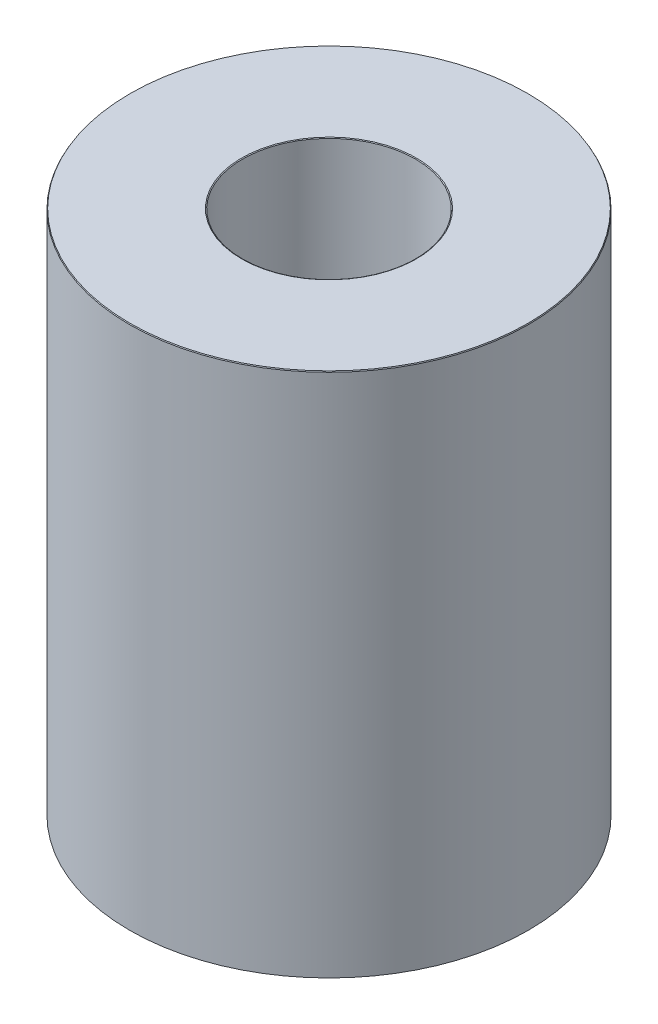
ISO-10303-21;
HEADER;
FILE_DESCRIPTION(('STEP AP214'),'2;1');
FILE_NAME('part.step','',(''),(''),'','','');
FILE_SCHEMA(('AUTOMOTIVE_DESIGN { 1 0 10303 214 1 1 1 1 }'));
ENDSEC;
DATA;
#1=APPLICATION_CONTEXT('core data for automotive mechanical design processes');
#2=APPLICATION_PROTOCOL_DEFINITION('international standard','automotive_design',2000,#1);
#3=PRODUCT_CONTEXT('',#1,'mechanical');
#4=PRODUCT('Part','Part','',(#3));
#5=PRODUCT_RELATED_PRODUCT_CATEGORY('part','',(#4));
#6=PRODUCT_DEFINITION_FORMATION('','',#4);
#7=PRODUCT_DEFINITION_CONTEXT('part definition',#1,'design');
#8=PRODUCT_DEFINITION('design','',#6,#7);
#9=PRODUCT_DEFINITION_SHAPE('','',#8);
#10=(LENGTH_UNIT() NAMED_UNIT(*) SI_UNIT(.MILLI.,.METRE.));
#11=(NAMED_UNIT(*) PLANE_ANGLE_UNIT() SI_UNIT($,.RADIAN.));
#12=(NAMED_UNIT(*) SI_UNIT($,.STERADIAN.) SOLID_ANGLE_UNIT());
#13=UNCERTAINTY_MEASURE_WITH_UNIT(LENGTH_MEASURE(1.E-05),#10,'distance_accuracy_value','');
#14=(GEOMETRIC_REPRESENTATION_CONTEXT(3) GLOBAL_UNCERTAINTY_ASSIGNED_CONTEXT((#13)) GLOBAL_UNIT_ASSIGNED_CONTEXT((#10,
#11,#12)) REPRESENTATION_CONTEXT('',''));
#15=CARTESIAN_POINT('',(0.,0.,0.));
#16=DIRECTION('',(0.,0.,1.));
#17=DIRECTION('',(1.,0.,0.));
#18=AXIS2_PLACEMENT_3D('',#15,#16,#17);
#19=CARTESIAN_POINT('',(0.,138.423819607549,0.));
#20=DIRECTION('',(0.,-1.,0.));
#21=DIRECTION('',(0.,0.,-1.));
#22=AXIS2_PLACEMENT_3D('',#19,#20,#21);
#23=CYLINDRICAL_SURFACE('',#22,52.5);
#24=CARTESIAN_POINT('',(0.,0.133273477539803,0.));
#25=DIRECTION('',(0.,1.,0.));
#26=DIRECTION('',(0.,0.,1.));
#27=AXIS2_PLACEMENT_3D('',#24,#25,#26);
#28=CIRCLE('',#27,52.5);
#29=CARTESIAN_POINT('',(0.,0.133273477539803,52.5));
#30=VERTEX_POINT('',#29);
#31=EDGE_CURVE('E10',#30,#30,#28,.T.);
#32=ORIENTED_EDGE('',*,*,#31,.T.);
#33=EDGE_LOOP('',(#32));
#34=FACE_BOUND('',#33,.T.);
#35=CARTESIAN_POINT('',(0.,138.192983173148,0.));
#36=DIRECTION('',(0.,1.,0.));
#37=DIRECTION('',(0.,0.,1.));
#38=AXIS2_PLACEMENT_3D('',#35,#36,#37);
#39=CIRCLE('',#38,52.5);
#40=CARTESIAN_POINT('',(0.,138.192983173148,52.5));
#41=VERTEX_POINT('',#40);
#42=EDGE_CURVE('E50',#41,#41,#39,.F.);
#43=ORIENTED_EDGE('',*,*,#42,.T.);
#44=EDGE_LOOP('',(#43));
#45=FACE_BOUND('',#44,.T.);
#46=ADVANCED_FACE('F39',(#34,#45),#23,.T.);
#47=CARTESIAN_POINT('',(0.,138.423819607549,0.));
#48=DIRECTION('',(0.,1.,0.));
#49=DIRECTION('',(0.,0.,1.));
#50=AXIS2_PLACEMENT_3D('',#47,#48,#49);
#51=PLANE('',#50);
#52=CARTESIAN_POINT('',(0.,138.423819607549,0.));
#53=DIRECTION('',(0.,1.,0.));
#54=DIRECTION('',(0.,0.,1.));
#55=AXIS2_PLACEMENT_3D('',#52,#53,#54);
#56=CIRCLE('',#55,23.0029149297858);
#57=CARTESIAN_POINT('',(0.,138.423819607549,23.0029149297858));
#58=VERTEX_POINT('',#57);
#59=EDGE_CURVE('E58',#58,#58,#56,.F.);
#60=ORIENTED_EDGE('',*,*,#59,.T.);
#61=EDGE_LOOP('',(#60));
#62=FACE_BOUND('',#61,.T.);
#63=CARTESIAN_POINT('',(0.,138.423819607549,0.));
#64=DIRECTION('',(0.,1.,0.));
#65=DIRECTION('',(0.,0.,1.));
#66=AXIS2_PLACEMENT_3D('',#63,#64,#65);
#67=CIRCLE('',#66,52.3667265224602);
#68=CARTESIAN_POINT('',(0.,138.423819607549,52.3667265224602));
#69=VERTEX_POINT('',#68);
#70=EDGE_CURVE('E61',#69,#69,#67,.T.);
#71=ORIENTED_EDGE('',*,*,#70,.T.);
#72=EDGE_LOOP('',(#71));
#73=FACE_BOUND('',#72,.T.);
#74=ADVANCED_FACE('F88',(#62,#73),#51,.T.);
#75=CARTESIAN_POINT('',(0.,0.,0.));
#76=DIRECTION('',(0.,1.,0.));
#77=DIRECTION('',(0.,0.,1.));
#78=AXIS2_PLACEMENT_3D('',#75,#76,#77);
#79=PLANE('',#78);
#80=CARTESIAN_POINT('',(0.,0.,0.));
#81=DIRECTION('',(0.,1.,0.));
#82=DIRECTION('',(0.,0.,1.));
#83=AXIS2_PLACEMENT_3D('',#80,#81,#82);
#84=CIRCLE('',#83,22.9053519729253);
#85=CARTESIAN_POINT('',(0.,0.,-22.9053519729253));
#86=VERTEX_POINT('',#85);
#87=EDGE_CURVE('E51',#86,#86,#84,.T.);
#88=ORIENTED_EDGE('',*,*,#87,.T.);
#89=EDGE_LOOP('',(#88));
#90=FACE_BOUND('',#89,.T.);
#91=CARTESIAN_POINT('',(0.,0.,0.));
#92=DIRECTION('',(0.,1.,0.));
#93=DIRECTION('',(0.,0.,1.));
#94=AXIS2_PLACEMENT_3D('',#91,#92,#93);
#95=CIRCLE('',#94,52.2691635655997);
#96=CARTESIAN_POINT('',(0.,0.,52.2691635655997));
#97=VERTEX_POINT('',#96);
#98=EDGE_CURVE('E54',#97,#97,#95,.F.);
#99=ORIENTED_EDGE('',*,*,#98,.T.);
#100=EDGE_LOOP('',(#99));
#101=FACE_BOUND('',#100,.T.);
#102=ADVANCED_FACE('F83',(#90,#101),#79,.F.);
#103=CARTESIAN_POINT('',(0.,138.423819607549,0.));
#104=DIRECTION('',(0.,-1.,0.));
#105=DIRECTION('',(0.,0.,-1.));
#106=AXIS2_PLACEMENT_3D('',#103,#104,#105);
#107=CYLINDRICAL_SURFACE('',#106,22.7720784953855);
#108=CARTESIAN_POINT('',(0.,138.290546130009,0.));
#109=DIRECTION('',(0.,1.,0.));
#110=DIRECTION('',(0.,0.,1.));
#111=AXIS2_PLACEMENT_3D('',#108,#109,#110);
#112=CIRCLE('',#111,22.7720784953855);
#113=CARTESIAN_POINT('',(0.,138.290546130009,22.7720784953855));
#114=VERTEX_POINT('',#113);
#115=EDGE_CURVE('E67',#114,#114,#112,.T.);
#116=ORIENTED_EDGE('',*,*,#115,.T.);
#117=EDGE_LOOP('',(#116));
#118=FACE_BOUND('',#117,.T.);
#119=CARTESIAN_POINT('',(0.,0.230836434400333,0.));
#120=DIRECTION('',(0.,1.,0.));
#121=DIRECTION('',(0.,0.,1.));
#122=AXIS2_PLACEMENT_3D('',#119,#120,#121);
#123=CIRCLE('',#122,22.7720784953855);
#124=CARTESIAN_POINT('',(0.,0.230836434400333,-22.7720784953855));
#125=VERTEX_POINT('',#124);
#126=EDGE_CURVE('E69',#125,#125,#123,.F.);
#127=ORIENTED_EDGE('',*,*,#126,.T.);
#128=EDGE_LOOP('',(#127));
#129=FACE_BOUND('',#128,.T.);
#130=ADVANCED_FACE('F71',(#118,#129),#107,.F.);
#131=CARTESIAN_POINT('',(0.,138.290546130009,0.));
#132=DIRECTION('',(0.,1.,0.));
#133=DIRECTION('',(0.,0.,1.));
#134=AXIS2_PLACEMENT_3D('',#131,#132,#133);
#135=CONICAL_SURFACE('',#134,22.7720784953855,1.04719755119655);
#136=ORIENTED_EDGE('',*,*,#59,.F.);
#137=EDGE_LOOP('',(#136));
#138=FACE_BOUND('',#137,.T.);
#139=ORIENTED_EDGE('',*,*,#115,.F.);
#140=EDGE_LOOP('',(#139));
#141=FACE_BOUND('',#140,.T.);
#142=ADVANCED_FACE('F77',(#138,#141),#135,.F.);
#143=CARTESIAN_POINT('',(0.,0.,0.));
#144=DIRECTION('',(0.,-1.,0.));
#145=DIRECTION('',(0.,0.,-1.));
#146=AXIS2_PLACEMENT_3D('',#143,#144,#145);
#147=CONICAL_SURFACE('',#146,22.9053519729253,0.523598775598322);
#148=CARTESIAN_POINT('',(0.,0.230836434400333,-22.7720784953855));
#149=CARTESIAN_POINT('',(0.,0.228431888208662,-22.7734667607765));
#150=CARTESIAN_POINT('',(0.,0.226027342016993,-22.7748550261675));
#151=CARTESIAN_POINT('',(0.,0.221218249633653,-22.7776315569496));
#152=CARTESIAN_POINT('',(0.,0.218813703441983,-22.7790198223407));
#153=CARTESIAN_POINT('',(0.,0.214004611058643,-22.7817963531227));
#154=CARTESIAN_POINT('',(0.,0.211600064866972,-22.7831846185138));
#155=CARTESIAN_POINT('',(0.,0.206790972483632,-22.7859611492959));
#156=CARTESIAN_POINT('',(0.,0.204386426291961,-22.7873494146869));
#157=CARTESIAN_POINT('',(0.,0.199577333908621,-22.790125945469));
#158=CARTESIAN_POINT('',(0.,0.197172787716951,-22.79151421086));
#159=CARTESIAN_POINT('',(0.,0.192363695333611,-22.7942907416421));
#160=CARTESIAN_POINT('',(0.,0.189959149141941,-22.7956790070331));
#161=CARTESIAN_POINT('',(0.,0.1851500567586,-22.7984555378152));
#162=CARTESIAN_POINT('',(0.,0.18274551056693,-22.7998438032063));
#163=CARTESIAN_POINT('',(0.,0.17793641818359,-22.8026203339883));
#164=CARTESIAN_POINT('',(0.,0.17553187199192,-22.8040085993794));
#165=CARTESIAN_POINT('',(0.,0.17072277960858,-22.8067851301615));
#166=CARTESIAN_POINT('',(0.,0.16831823341691,-22.8081733955525));
#167=CARTESIAN_POINT('',(0.,0.163509141033569,-22.8109499263346));
#168=CARTESIAN_POINT('',(0.,0.161104594841899,-22.8123381917256));
#169=CARTESIAN_POINT('',(0.,0.156295502458559,-22.8151147225077));
#170=CARTESIAN_POINT('',(0.,0.153890956266889,-22.8165029878987));
#171=CARTESIAN_POINT('',(0.,0.149081863883549,-22.8192795186808));
#172=CARTESIAN_POINT('',(0.,0.146677317691879,-22.8206677840718));
#173=CARTESIAN_POINT('',(0.,0.141868225308538,-22.8234443148539));
#174=CARTESIAN_POINT('',(0.,0.139463679116868,-22.824832580245));
#175=CARTESIAN_POINT('',(0.,0.134654586733528,-22.827609111027));
#176=CARTESIAN_POINT('',(0.,0.132250040541858,-22.8289973764181));
#177=CARTESIAN_POINT('',(0.,0.127440948158518,-22.8317739072002));
#178=CARTESIAN_POINT('',(0.,0.125036401966847,-22.8331621725912));
#179=CARTESIAN_POINT('',(0.,0.120227309583507,-22.8359387033733));
#180=CARTESIAN_POINT('',(0.,0.117822763391836,-22.8373269687643));
#181=CARTESIAN_POINT('',(0.,0.113013671008496,-22.8401034995464));
#182=CARTESIAN_POINT('',(0.,0.110609124816827,-22.8414917649374));
#183=CARTESIAN_POINT('',(0.,0.105800032433486,-22.8442682957195));
#184=CARTESIAN_POINT('',(0.,0.103395486241816,-22.8456565611106));
#185=CARTESIAN_POINT('',(0.,0.0985863938584754,-22.8484330918926));
#186=CARTESIAN_POINT('',(0.,0.0961818476668057,-22.8498213572837));
#187=CARTESIAN_POINT('',(0.,0.0913727552834656,-22.8525978880658));
#188=CARTESIAN_POINT('',(0.,0.0889682090917953,-22.8539861534568));
#189=CARTESIAN_POINT('',(0.,0.0841591167084547,-22.8567626842389));
#190=CARTESIAN_POINT('',(0.,0.0817545705167844,-22.8581509496299));
#191=CARTESIAN_POINT('',(0.,0.0769454781334443,-22.860927480412));
#192=CARTESIAN_POINT('',(0.,0.0745409319417744,-22.862315745803));
#193=CARTESIAN_POINT('',(0.,0.0697318395584343,-22.8650922765851));
#194=CARTESIAN_POINT('',(0.,0.067327293366764,-22.8664805419762));
#195=CARTESIAN_POINT('',(0.,0.0625182009834234,-22.8692570727582));
#196=CARTESIAN_POINT('',(0.,0.0601136547917531,-22.8706453381493));
#197=CARTESIAN_POINT('',(0.,0.055304562408413,-22.8734218689314));
#198=CARTESIAN_POINT('',(0.,0.0529000162167432,-22.8748101343224));
#199=CARTESIAN_POINT('',(0.,0.0480909238334031,-22.8775866651045));
#200=CARTESIAN_POINT('',(0.,0.0456863776417328,-22.8789749304955));
#201=CARTESIAN_POINT('',(0.,0.0408772852583922,-22.8817514612776));
#202=CARTESIAN_POINT('',(0.,0.0384727390667219,-22.8831397266686));
#203=CARTESIAN_POINT('',(0.,0.0336636466833818,-22.8859162574507));
#204=CARTESIAN_POINT('',(0.,0.031259100491712,-22.8873045228418));
#205=CARTESIAN_POINT('',(0.,0.0264500081083719,-22.8900810536238));
#206=CARTESIAN_POINT('',(0.,0.0240454619167015,-22.8914693190149));
#207=CARTESIAN_POINT('',(0.,0.0192363695333609,-22.894245849797));
#208=CARTESIAN_POINT('',(0.,0.0168318233416907,-22.895634115188));
#209=CARTESIAN_POINT('',(0.,0.0120227309583505,-22.8984106459701));
#210=CARTESIAN_POINT('',(0.,0.00961818476668058,-22.8997989113611));
#211=CARTESIAN_POINT('',(0.,0.00480909238334076,-22.9025754421432));
#212=CARTESIAN_POINT('',(0.,0.00240454619167085,-22.9039637075342));
#213=CARTESIAN_POINT('',(0.,0.,-22.9053519729253));
#214=B_SPLINE_CURVE_WITH_KNOTS('',3,(#148,#149,#150,#151,#152,#153,#154,#155,#156,#157,#158,
#159,#160,#161,#162,#163,#164,#165,#166,#167,#168,#169,#170,#171,#172,#173,#174,#175,#176,#177,
#178,#179,#180,#181,#182,#183,#184,#185,#186,#187,#188,#189,#190,#191,#192,#193,#194,#195,#196,
#197,#198,#199,#200,#201,#202,#203,#204,#205,#206,#207,#208,#209,#210,#211,#212,#213),
.UNSPECIFIED.,.F.,.F.,(4,2,2,2,2,2,2,2,2,2,2,2,2,2,2,2,2,2,2,2,2,2,2,2,2,2,2,2,2,2,2,2,4),(0.,
0.00832959234623738,0.0166591846924765,0.0249887770387139,0.0333183693849513,0.0416479617311904,
0.0499775540774277,0.0583071464236651,0.0666367387699042,0.0749663311161416,0.083295923462379,
0.0916255158086181,0.0999551081548555,0.108284700501093,0.116614292847332,0.124943885193569,
0.133273477539807,0.141603069886046,0.149932662232283,0.158262254578522,0.16659184692476,
0.174921439270997,0.183251031617236,0.191580623963474,0.199910216309711,0.20823980865595,
0.216569401002187,0.224898993348425,0.233228585694664,0.241558178040901,0.249887770387139,
0.258217362733378,0.266546955079615),.UNSPECIFIED.);
#215=EDGE_CURVE('BSEAM73',#125,#86,#214,.T.);
#216=ORIENTED_EDGE('',*,*,#126,.F.);
#217=ORIENTED_EDGE('',*,*,#87,.F.);
#218=ORIENTED_EDGE('',*,*,#215,.T.);
#219=ORIENTED_EDGE('',*,*,#215,.F.);
#220=EDGE_LOOP('',(#216,#218,#217,#219));
#221=FACE_BOUND('',#220,.T.);
#222=ADVANCED_FACE('F73',(#221),#147,.F.);
#223=CARTESIAN_POINT('',(0.,0.133273477539803,0.));
#224=DIRECTION('',(0.,1.,0.));
#225=DIRECTION('',(0.,0.,1.));
#226=AXIS2_PLACEMENT_3D('',#223,#224,#225);
#227=CONICAL_SURFACE('',#226,52.5,1.04719755119654);
#228=ORIENTED_EDGE('',*,*,#98,.F.);
#229=EDGE_LOOP('',(#228));
#230=FACE_BOUND('',#229,.T.);
#231=ORIENTED_EDGE('',*,*,#31,.F.);
#232=EDGE_LOOP('',(#231));
#233=FACE_BOUND('',#232,.T.);
#234=ADVANCED_FACE('F76',(#230,#233),#227,.T.);
#235=CARTESIAN_POINT('',(0.,138.423819607549,0.));
#236=DIRECTION('',(0.,-1.,0.));
#237=DIRECTION('',(0.,0.,-1.));
#238=AXIS2_PLACEMENT_3D('',#235,#236,#237);
#239=CONICAL_SURFACE('',#238,52.3667265224602,0.523598775598259);
#240=ORIENTED_EDGE('',*,*,#42,.F.);
#241=EDGE_LOOP('',(#240));
#242=FACE_BOUND('',#241,.T.);
#243=ORIENTED_EDGE('',*,*,#70,.F.);
#244=EDGE_LOOP('',(#243));
#245=FACE_BOUND('',#244,.T.);
#246=ADVANCED_FACE('F45',(#242,#245),#239,.T.);
#247=CLOSED_SHELL('',(#46,#74,#102,#130,#142,#222,#234,#246));
#248=MANIFOLD_SOLID_BREP('B2',#247);
#249=ADVANCED_BREP_SHAPE_REPRESENTATION('',(#18,#248),#14);
#250=SHAPE_DEFINITION_REPRESENTATION(#9,#249);
ENDSEC;
END-ISO-10303-21;
